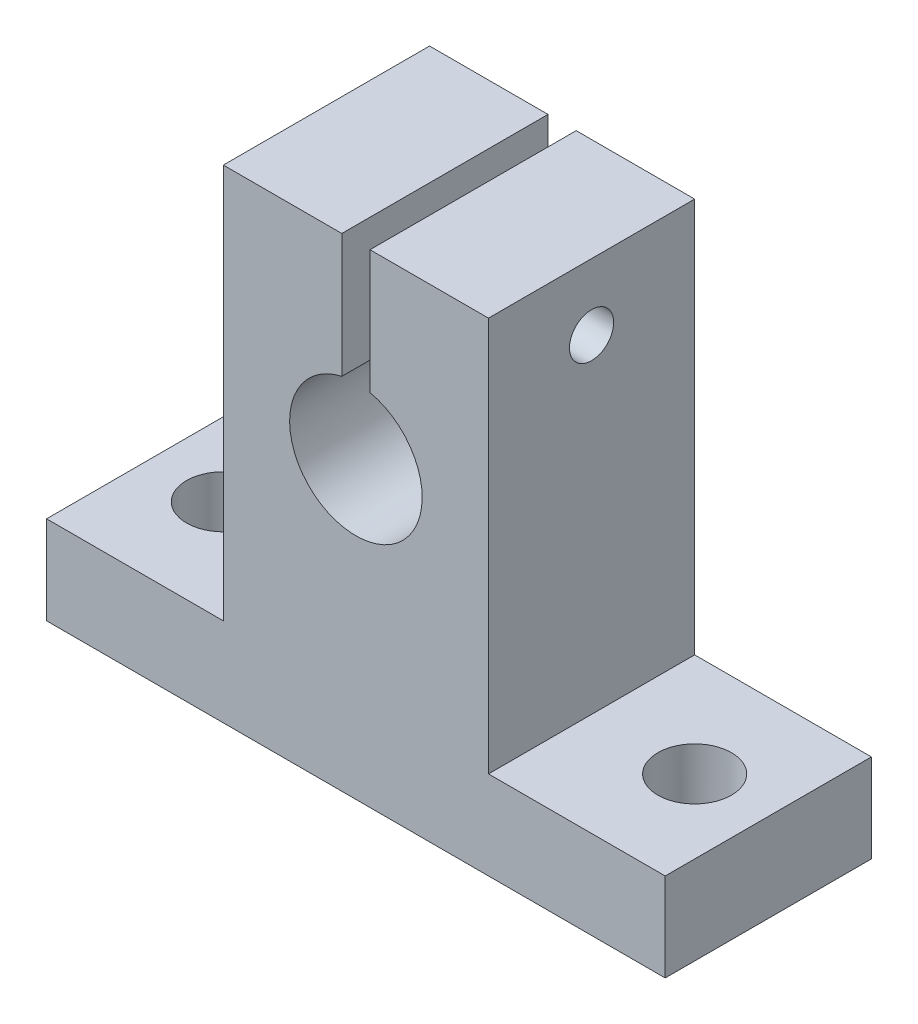
ISO-10303-21;
HEADER;
FILE_DESCRIPTION(('STEP AP214'),'2;1');
FILE_NAME('part.step','',(''),(''),'','','');
FILE_SCHEMA(('AUTOMOTIVE_DESIGN { 1 0 10303 214 1 1 1 1 }'));
ENDSEC;
DATA;
#1=APPLICATION_CONTEXT('core data for automotive mechanical design processes');
#2=APPLICATION_PROTOCOL_DEFINITION('international standard','automotive_design',2000,#1);
#3=PRODUCT_CONTEXT('',#1,'mechanical');
#4=PRODUCT('Part','Part','',(#3));
#5=PRODUCT_RELATED_PRODUCT_CATEGORY('part','',(#4));
#6=PRODUCT_DEFINITION_FORMATION('','',#4);
#7=PRODUCT_DEFINITION_CONTEXT('part definition',#1,'design');
#8=PRODUCT_DEFINITION('design','',#6,#7);
#9=PRODUCT_DEFINITION_SHAPE('','',#8);
#10=(LENGTH_UNIT() NAMED_UNIT(*) SI_UNIT(.MILLI.,.METRE.));
#11=(NAMED_UNIT(*) PLANE_ANGLE_UNIT() SI_UNIT($,.RADIAN.));
#12=(NAMED_UNIT(*) SI_UNIT($,.STERADIAN.) SOLID_ANGLE_UNIT());
#13=UNCERTAINTY_MEASURE_WITH_UNIT(LENGTH_MEASURE(1.E-05),#10,'distance_accuracy_value','');
#14=(GEOMETRIC_REPRESENTATION_CONTEXT(3) GLOBAL_UNCERTAINTY_ASSIGNED_CONTEXT((#13)) GLOBAL_UNIT_ASSIGNED_CONTEXT((#10,
#11,#12)) REPRESENTATION_CONTEXT('',''));
#15=CARTESIAN_POINT('',(0.,0.,0.));
#16=DIRECTION('',(0.,0.,1.));
#17=DIRECTION('',(1.,0.,0.));
#18=AXIS2_PLACEMENT_3D('',#15,#16,#17);
#19=CARTESIAN_POINT('',(21.,3.,14.));
#20=DIRECTION('',(-1.,0.,0.));
#21=DIRECTION('',(0.,0.,1.));
#22=AXIS2_PLACEMENT_3D('',#19,#20,#21);
#23=PLANE('',#22);
#24=DIRECTION('',(0.,1.,0.));
#25=VECTOR('',#24,1.);
#26=CARTESIAN_POINT('',(21.,3.,0.));
#27=LINE('',#26,#25);
#28=CARTESIAN_POINT('',(21.,-3.,0.));
#29=VERTEX_POINT('',#28);
#30=CARTESIAN_POINT('',(21.,3.,0.));
#31=VERTEX_POINT('',#30);
#32=EDGE_CURVE('E154',#29,#31,#27,.T.);
#33=ORIENTED_EDGE('',*,*,#32,.T.);
#34=DIRECTION('',(0.,0.,-1.));
#35=VECTOR('',#34,1.);
#36=CARTESIAN_POINT('',(21.,3.,14.));
#37=LINE('',#36,#35);
#38=CARTESIAN_POINT('',(21.,3.,14.));
#39=VERTEX_POINT('',#38);
#40=EDGE_CURVE('E11',#39,#31,#37,.T.);
#41=ORIENTED_EDGE('',*,*,#40,.F.);
#42=DIRECTION('',(0.,1.,0.));
#43=VECTOR('',#42,1.);
#44=CARTESIAN_POINT('',(21.,3.,14.));
#45=LINE('',#44,#43);
#46=CARTESIAN_POINT('',(21.,-3.,14.));
#47=VERTEX_POINT('',#46);
#48=EDGE_CURVE('E177',#47,#39,#45,.T.);
#49=ORIENTED_EDGE('',*,*,#48,.F.);
#50=DIRECTION('',(0.,0.,-1.));
#51=VECTOR('',#50,1.);
#52=CARTESIAN_POINT('',(21.,-3.,14.));
#53=LINE('',#52,#51);
#54=EDGE_CURVE('E150',#47,#29,#53,.T.);
#55=ORIENTED_EDGE('',*,*,#54,.T.);
#56=EDGE_LOOP('',(#33,#41,#49,#55));
#57=FACE_BOUND('',#56,.T.);
#58=ADVANCED_FACE('F34',(#57),#23,.F.);
#59=CARTESIAN_POINT('',(9.,3.,14.));
#60=DIRECTION('',(0.,-1.,0.));
#61=DIRECTION('',(1.,0.,0.));
#62=AXIS2_PLACEMENT_3D('',#59,#60,#61);
#63=PLANE('',#62);
#64=CARTESIAN_POINT('',(16.,3.,7.));
#65=DIRECTION('',(0.,1.,0.));
#66=DIRECTION('',(1.,0.,0.));
#67=AXIS2_PLACEMENT_3D('',#64,#65,#66);
#68=CIRCLE('',#67,2.5);
#69=CARTESIAN_POINT('',(18.5,3.,7.));
#70=VERTEX_POINT('',#69);
#71=EDGE_CURVE('E303',#70,#70,#68,.T.);
#72=ORIENTED_EDGE('',*,*,#71,.F.);
#73=EDGE_LOOP('',(#72));
#74=FACE_BOUND('',#73,.T.);
#75=DIRECTION('',(-1.,0.,0.));
#76=VECTOR('',#75,1.);
#77=CARTESIAN_POINT('',(9.,3.,0.));
#78=LINE('',#77,#76);
#79=CARTESIAN_POINT('',(9.,3.,0.));
#80=VERTEX_POINT('',#79);
#81=EDGE_CURVE('E157',#31,#80,#78,.T.);
#82=ORIENTED_EDGE('',*,*,#81,.T.);
#83=DIRECTION('',(0.,0.,-1.));
#84=VECTOR('',#83,1.);
#85=CARTESIAN_POINT('',(9.,3.,14.));
#86=LINE('',#85,#84);
#87=CARTESIAN_POINT('',(9.,3.,14.));
#88=VERTEX_POINT('',#87);
#89=EDGE_CURVE('E42',#88,#80,#86,.T.);
#90=ORIENTED_EDGE('',*,*,#89,.F.);
#91=DIRECTION('',(-1.,0.,0.));
#92=VECTOR('',#91,1.);
#93=CARTESIAN_POINT('',(9.,3.,14.));
#94=LINE('',#93,#92);
#95=EDGE_CURVE('E105',#39,#88,#94,.T.);
#96=ORIENTED_EDGE('',*,*,#95,.F.);
#97=ORIENTED_EDGE('',*,*,#40,.T.);
#98=EDGE_LOOP('',(#82,#90,#96,#97));
#99=FACE_BOUND('',#98,.T.);
#100=ADVANCED_FACE('F260',(#74,#99),#63,.F.);
#101=CARTESIAN_POINT('',(9.,29.8,14.));
#102=DIRECTION('',(-1.,0.,0.));
#103=DIRECTION('',(0.,-1.,0.));
#104=AXIS2_PLACEMENT_3D('',#101,#102,#103);
#105=PLANE('',#104);
#106=CARTESIAN_POINT('',(9.,25.3,7.));
#107=DIRECTION('',(-1.,0.,0.));
#108=DIRECTION('',(0.,-1.,0.));
#109=AXIS2_PLACEMENT_3D('',#106,#107,#108);
#110=CIRCLE('',#109,1.5);
#111=CARTESIAN_POINT('',(9.,23.8,7.));
#112=VERTEX_POINT('',#111);
#113=EDGE_CURVE('E306',#112,#112,#110,.T.);
#114=ORIENTED_EDGE('',*,*,#113,.T.);
#115=EDGE_LOOP('',(#114));
#116=FACE_BOUND('',#115,.T.);
#117=DIRECTION('',(0.,1.,0.));
#118=VECTOR('',#117,1.);
#119=CARTESIAN_POINT('',(9.,29.8,0.));
#120=LINE('',#119,#118);
#121=CARTESIAN_POINT('',(9.,29.8,0.));
#122=VERTEX_POINT('',#121);
#123=EDGE_CURVE('E160',#80,#122,#120,.T.);
#124=ORIENTED_EDGE('',*,*,#123,.T.);
#125=DIRECTION('',(0.,0.,-1.));
#126=VECTOR('',#125,1.);
#127=CARTESIAN_POINT('',(9.,29.8,14.));
#128=LINE('',#127,#126);
#129=CARTESIAN_POINT('',(9.,29.8,14.));
#130=VERTEX_POINT('',#129);
#131=EDGE_CURVE('E196',#130,#122,#128,.T.);
#132=ORIENTED_EDGE('',*,*,#131,.F.);
#133=DIRECTION('',(0.,1.,0.));
#134=VECTOR('',#133,1.);
#135=CARTESIAN_POINT('',(9.,29.8,14.));
#136=LINE('',#135,#134);
#137=EDGE_CURVE('E204',#88,#130,#136,.T.);
#138=ORIENTED_EDGE('',*,*,#137,.F.);
#139=ORIENTED_EDGE('',*,*,#89,.T.);
#140=EDGE_LOOP('',(#124,#132,#138,#139));
#141=FACE_BOUND('',#140,.T.);
#142=ADVANCED_FACE('F202',(#116,#141),#105,.F.);
#143=CARTESIAN_POINT('',(0.956301859519476,29.8,14.));
#144=DIRECTION('',(0.,-1.,0.));
#145=DIRECTION('',(0.,0.,-1.));
#146=AXIS2_PLACEMENT_3D('',#143,#144,#145);
#147=PLANE('',#146);
#148=DIRECTION('',(-1.,0.,0.));
#149=VECTOR('',#148,1.);
#150=CARTESIAN_POINT('',(0.956301859519476,29.8,0.));
#151=LINE('',#150,#149);
#152=CARTESIAN_POINT('',(0.956301859519476,29.8,0.));
#153=VERTEX_POINT('',#152);
#154=EDGE_CURVE('E162',#122,#153,#151,.T.);
#155=ORIENTED_EDGE('',*,*,#154,.T.);
#156=DIRECTION('',(0.,0.,-1.));
#157=VECTOR('',#156,1.);
#158=CARTESIAN_POINT('',(0.956301859519476,29.8,14.));
#159=LINE('',#158,#157);
#160=CARTESIAN_POINT('',(0.956301859519476,29.8,14.));
#161=VERTEX_POINT('',#160);
#162=EDGE_CURVE('E193',#161,#153,#159,.T.);
#163=ORIENTED_EDGE('',*,*,#162,.F.);
#164=DIRECTION('',(-1.,0.,0.));
#165=VECTOR('',#164,1.);
#166=CARTESIAN_POINT('',(0.956301859519476,29.8,14.));
#167=LINE('',#166,#165);
#168=EDGE_CURVE('E222',#130,#161,#167,.T.);
#169=ORIENTED_EDGE('',*,*,#168,.F.);
#170=ORIENTED_EDGE('',*,*,#131,.T.);
#171=EDGE_LOOP('',(#155,#163,#169,#170));
#172=FACE_BOUND('',#171,.T.);
#173=ADVANCED_FACE('F213',(#172),#147,.F.);
#174=CARTESIAN_POINT('',(0.956301859519476,29.8,14.));
#175=DIRECTION('',(1.,0.,0.));
#176=DIRECTION('',(0.,1.,0.));
#177=AXIS2_PLACEMENT_3D('',#174,#175,#176);
#178=PLANE('',#177);
#179=CARTESIAN_POINT('',(0.956301859519476,25.3,7.));
#180=DIRECTION('',(1.,0.,0.));
#181=DIRECTION('',(0.,1.,0.));
#182=AXIS2_PLACEMENT_3D('',#179,#180,#181);
#183=CIRCLE('',#182,1.5);
#184=CARTESIAN_POINT('',(0.956301859519477,26.8,7.));
#185=VERTEX_POINT('',#184);
#186=EDGE_CURVE('E314',#185,#185,#183,.T.);
#187=ORIENTED_EDGE('',*,*,#186,.T.);
#188=EDGE_LOOP('',(#187));
#189=FACE_BOUND('',#188,.T.);
#190=DIRECTION('',(0.,-1.,0.));
#191=VECTOR('',#190,1.);
#192=CARTESIAN_POINT('',(0.956301859519476,29.8,0.));
#193=LINE('',#192,#191);
#194=CARTESIAN_POINT('',(0.956301859519474,21.3972135214792,0.));
#195=VERTEX_POINT('',#194);
#196=EDGE_CURVE('E164',#153,#195,#193,.T.);
#197=ORIENTED_EDGE('',*,*,#196,.T.);
#198=DIRECTION('',(0.,0.,-1.));
#199=VECTOR('',#198,1.);
#200=CARTESIAN_POINT('',(0.956301859519474,21.3972135214792,14.));
#201=LINE('',#200,#199);
#202=CARTESIAN_POINT('',(0.956301859519474,21.3972135214792,14.));
#203=VERTEX_POINT('',#202);
#204=EDGE_CURVE('E190',#203,#195,#201,.T.);
#205=ORIENTED_EDGE('',*,*,#204,.F.);
#206=DIRECTION('',(0.,-1.,0.));
#207=VECTOR('',#206,1.);
#208=CARTESIAN_POINT('',(0.956301859519476,29.8,14.));
#209=LINE('',#208,#207);
#210=EDGE_CURVE('E219',#161,#203,#209,.T.);
#211=ORIENTED_EDGE('',*,*,#210,.F.);
#212=ORIENTED_EDGE('',*,*,#162,.T.);
#213=EDGE_LOOP('',(#197,#205,#211,#212));
#214=FACE_BOUND('',#213,.T.);
#215=ADVANCED_FACE('F217',(#189,#214),#178,.F.);
#216=CARTESIAN_POINT('',(0.,17.,14.));
#217=DIRECTION('',(0.,0.,-1.));
#218=DIRECTION('',(-1.,0.,0.));
#219=AXIS2_PLACEMENT_3D('',#216,#217,#218);
#220=CYLINDRICAL_SURFACE('',#219,4.5);
#221=CARTESIAN_POINT('',(0.,17.,0.));
#222=DIRECTION('',(0.,0.,-1.));
#223=DIRECTION('',(1.,0.,0.));
#224=AXIS2_PLACEMENT_3D('',#221,#222,#223);
#225=CIRCLE('',#224,4.5);
#226=CARTESIAN_POINT('',(-0.956301859519469,21.3972135214792,0.));
#227=VERTEX_POINT('',#226);
#228=EDGE_CURVE('E166',#195,#227,#225,.T.);
#229=ORIENTED_EDGE('',*,*,#228,.T.);
#230=DIRECTION('',(0.,0.,-1.));
#231=VECTOR('',#230,1.);
#232=CARTESIAN_POINT('',(-0.956301859519469,21.3972135214792,14.));
#233=LINE('',#232,#231);
#234=CARTESIAN_POINT('',(-0.956301859519469,21.3972135214792,14.));
#235=VERTEX_POINT('',#234);
#236=EDGE_CURVE('E187',#235,#227,#233,.T.);
#237=ORIENTED_EDGE('',*,*,#236,.F.);
#238=CARTESIAN_POINT('',(0.,17.,14.));
#239=DIRECTION('',(0.,0.,-1.));
#240=DIRECTION('',(1.,0.,0.));
#241=AXIS2_PLACEMENT_3D('',#238,#239,#240);
#242=CIRCLE('',#241,4.5);
#243=EDGE_CURVE('E221',#203,#235,#242,.T.);
#244=ORIENTED_EDGE('',*,*,#243,.F.);
#245=ORIENTED_EDGE('',*,*,#204,.T.);
#246=EDGE_LOOP('',(#229,#237,#244,#245));
#247=FACE_BOUND('',#246,.T.);
#248=ADVANCED_FACE('F277',(#247),#220,.F.);
#249=CARTESIAN_POINT('',(-0.956301859519469,29.8,14.));
#250=DIRECTION('',(-1.,0.,0.));
#251=DIRECTION('',(0.,0.,1.));
#252=AXIS2_PLACEMENT_3D('',#249,#250,#251);
#253=PLANE('',#252);
#254=CARTESIAN_POINT('',(-0.956301859519469,25.3,7.));
#255=DIRECTION('',(-1.,0.,0.));
#256=DIRECTION('',(0.,0.,1.));
#257=AXIS2_PLACEMENT_3D('',#254,#255,#256);
#258=CIRCLE('',#257,1.5);
#259=CARTESIAN_POINT('',(-0.956301859519469,25.3,8.5));
#260=VERTEX_POINT('',#259);
#261=EDGE_CURVE('E317',#260,#260,#258,.T.);
#262=ORIENTED_EDGE('',*,*,#261,.T.);
#263=EDGE_LOOP('',(#262));
#264=FACE_BOUND('',#263,.T.);
#265=DIRECTION('',(0.,1.,0.));
#266=VECTOR('',#265,1.);
#267=CARTESIAN_POINT('',(-0.956301859519469,29.8,0.));
#268=LINE('',#267,#266);
#269=CARTESIAN_POINT('',(-0.956301859519469,29.8,0.));
#270=VERTEX_POINT('',#269);
#271=EDGE_CURVE('E168',#227,#270,#268,.T.);
#272=ORIENTED_EDGE('',*,*,#271,.T.);
#273=DIRECTION('',(0.,0.,-1.));
#274=VECTOR('',#273,1.);
#275=CARTESIAN_POINT('',(-0.956301859519469,29.8,14.));
#276=LINE('',#275,#274);
#277=CARTESIAN_POINT('',(-0.956301859519469,29.8,14.));
#278=VERTEX_POINT('',#277);
#279=EDGE_CURVE('E184',#278,#270,#276,.T.);
#280=ORIENTED_EDGE('',*,*,#279,.F.);
#281=DIRECTION('',(0.,1.,0.));
#282=VECTOR('',#281,1.);
#283=CARTESIAN_POINT('',(-0.956301859519469,29.8,14.));
#284=LINE('',#283,#282);
#285=EDGE_CURVE('E224',#235,#278,#284,.T.);
#286=ORIENTED_EDGE('',*,*,#285,.F.);
#287=ORIENTED_EDGE('',*,*,#236,.T.);
#288=EDGE_LOOP('',(#272,#280,#286,#287));
#289=FACE_BOUND('',#288,.T.);
#290=ADVANCED_FACE('F281',(#264,#289),#253,.F.);
#291=CARTESIAN_POINT('',(-9.,29.8,14.));
#292=DIRECTION('',(0.,-1.,0.));
#293=DIRECTION('',(0.,0.,-1.));
#294=AXIS2_PLACEMENT_3D('',#291,#292,#293);
#295=PLANE('',#294);
#296=DIRECTION('',(-1.,0.,0.));
#297=VECTOR('',#296,1.);
#298=CARTESIAN_POINT('',(-9.,29.8,0.));
#299=LINE('',#298,#297);
#300=CARTESIAN_POINT('',(-9.,29.8,0.));
#301=VERTEX_POINT('',#300);
#302=EDGE_CURVE('E170',#270,#301,#299,.T.);
#303=ORIENTED_EDGE('',*,*,#302,.T.);
#304=DIRECTION('',(0.,0.,-1.));
#305=VECTOR('',#304,1.);
#306=CARTESIAN_POINT('',(-9.,29.8,14.));
#307=LINE('',#306,#305);
#308=CARTESIAN_POINT('',(-9.,29.8,14.));
#309=VERTEX_POINT('',#308);
#310=EDGE_CURVE('E181',#309,#301,#307,.T.);
#311=ORIENTED_EDGE('',*,*,#310,.F.);
#312=DIRECTION('',(-1.,0.,0.));
#313=VECTOR('',#312,1.);
#314=CARTESIAN_POINT('',(-9.,29.8,14.));
#315=LINE('',#314,#313);
#316=EDGE_CURVE('E230',#278,#309,#315,.T.);
#317=ORIENTED_EDGE('',*,*,#316,.F.);
#318=ORIENTED_EDGE('',*,*,#279,.T.);
#319=EDGE_LOOP('',(#303,#311,#317,#318));
#320=FACE_BOUND('',#319,.T.);
#321=ADVANCED_FACE('F236',(#320),#295,.F.);
#322=CARTESIAN_POINT('',(-9.,29.8,14.));
#323=DIRECTION('',(1.,0.,0.));
#324=DIRECTION('',(0.,1.,0.));
#325=AXIS2_PLACEMENT_3D('',#322,#323,#324);
#326=PLANE('',#325);
#327=CARTESIAN_POINT('',(-9.,25.3,7.));
#328=DIRECTION('',(-1.,0.,0.));
#329=DIRECTION('',(0.,-1.,0.));
#330=AXIS2_PLACEMENT_3D('',#327,#328,#329);
#331=CIRCLE('',#330,1.5);
#332=CARTESIAN_POINT('',(-9.,23.8,7.));
#333=VERTEX_POINT('',#332);
#334=EDGE_CURVE('E320',#333,#333,#331,.T.);
#335=ORIENTED_EDGE('',*,*,#334,.F.);
#336=EDGE_LOOP('',(#335));
#337=FACE_BOUND('',#336,.T.);
#338=DIRECTION('',(0.,-1.,0.));
#339=VECTOR('',#338,1.);
#340=CARTESIAN_POINT('',(-9.,29.8,0.));
#341=LINE('',#340,#339);
#342=CARTESIAN_POINT('',(-9.,3.,0.));
#343=VERTEX_POINT('',#342);
#344=EDGE_CURVE('E172',#301,#343,#341,.T.);
#345=ORIENTED_EDGE('',*,*,#344,.T.);
#346=DIRECTION('',(0.,0.,-1.));
#347=VECTOR('',#346,1.);
#348=CARTESIAN_POINT('',(-9.,3.,14.));
#349=LINE('',#348,#347);
#350=CARTESIAN_POINT('',(-9.,3.,14.));
#351=VERTEX_POINT('',#350);
#352=EDGE_CURVE('E145',#351,#343,#349,.T.);
#353=ORIENTED_EDGE('',*,*,#352,.F.);
#354=DIRECTION('',(0.,-1.,0.));
#355=VECTOR('',#354,1.);
#356=CARTESIAN_POINT('',(-9.,29.8,14.));
#357=LINE('',#356,#355);
#358=EDGE_CURVE('E136',#309,#351,#357,.T.);
#359=ORIENTED_EDGE('',*,*,#358,.F.);
#360=ORIENTED_EDGE('',*,*,#310,.T.);
#361=EDGE_LOOP('',(#345,#353,#359,#360));
#362=FACE_BOUND('',#361,.T.);
#363=ADVANCED_FACE('F240',(#337,#362),#326,.F.);
#364=CARTESIAN_POINT('',(-21.,3.,14.));
#365=DIRECTION('',(0.,-1.,0.));
#366=DIRECTION('',(1.,0.,0.));
#367=AXIS2_PLACEMENT_3D('',#364,#365,#366);
#368=PLANE('',#367);
#369=CARTESIAN_POINT('',(-16.,3.,7.));
#370=DIRECTION('',(0.,1.,0.));
#371=DIRECTION('',(-1.,0.,0.));
#372=AXIS2_PLACEMENT_3D('',#369,#370,#371);
#373=CIRCLE('',#372,2.5);
#374=CARTESIAN_POINT('',(-18.5,3.,7.));
#375=VERTEX_POINT('',#374);
#376=EDGE_CURVE('E296',#375,#375,#373,.T.);
#377=ORIENTED_EDGE('',*,*,#376,.F.);
#378=EDGE_LOOP('',(#377));
#379=FACE_BOUND('',#378,.T.);
#380=DIRECTION('',(-1.,0.,0.));
#381=VECTOR('',#380,1.);
#382=CARTESIAN_POINT('',(-21.,3.,0.));
#383=LINE('',#382,#381);
#384=CARTESIAN_POINT('',(-21.,3.,0.));
#385=VERTEX_POINT('',#384);
#386=EDGE_CURVE('E144',#343,#385,#383,.T.);
#387=ORIENTED_EDGE('',*,*,#386,.T.);
#388=DIRECTION('',(0.,0.,-1.));
#389=VECTOR('',#388,1.);
#390=CARTESIAN_POINT('',(-21.,3.,14.));
#391=LINE('',#390,#389);
#392=CARTESIAN_POINT('',(-21.,3.,14.));
#393=VERTEX_POINT('',#392);
#394=EDGE_CURVE('E141',#393,#385,#391,.T.);
#395=ORIENTED_EDGE('',*,*,#394,.F.);
#396=DIRECTION('',(-1.,0.,0.));
#397=VECTOR('',#396,1.);
#398=CARTESIAN_POINT('',(-21.,3.,14.));
#399=LINE('',#398,#397);
#400=EDGE_CURVE('E130',#351,#393,#399,.T.);
#401=ORIENTED_EDGE('',*,*,#400,.F.);
#402=ORIENTED_EDGE('',*,*,#352,.T.);
#403=EDGE_LOOP('',(#387,#395,#401,#402));
#404=FACE_BOUND('',#403,.T.);
#405=ADVANCED_FACE('F142',(#379,#404),#368,.F.);
#406=CARTESIAN_POINT('',(-21.,3.,14.));
#407=DIRECTION('',(1.,0.,0.));
#408=DIRECTION('',(0.,0.,-1.));
#409=AXIS2_PLACEMENT_3D('',#406,#407,#408);
#410=PLANE('',#409);
#411=DIRECTION('',(0.,-1.,0.));
#412=VECTOR('',#411,1.);
#413=CARTESIAN_POINT('',(-21.,3.,0.));
#414=LINE('',#413,#412);
#415=CARTESIAN_POINT('',(-21.,-3.,0.));
#416=VERTEX_POINT('',#415);
#417=EDGE_CURVE('E91',#385,#416,#414,.T.);
#418=ORIENTED_EDGE('',*,*,#417,.T.);
#419=DIRECTION('',(0.,0.,-1.));
#420=VECTOR('',#419,1.);
#421=CARTESIAN_POINT('',(-21.,-3.,14.));
#422=LINE('',#421,#420);
#423=CARTESIAN_POINT('',(-21.,-3.,14.));
#424=VERTEX_POINT('',#423);
#425=EDGE_CURVE('E146',#424,#416,#422,.T.);
#426=ORIENTED_EDGE('',*,*,#425,.F.);
#427=DIRECTION('',(0.,-1.,0.));
#428=VECTOR('',#427,1.);
#429=CARTESIAN_POINT('',(-21.,3.,14.));
#430=LINE('',#429,#428);
#431=EDGE_CURVE('E134',#393,#424,#430,.T.);
#432=ORIENTED_EDGE('',*,*,#431,.F.);
#433=ORIENTED_EDGE('',*,*,#394,.T.);
#434=EDGE_LOOP('',(#418,#426,#432,#433));
#435=FACE_BOUND('',#434,.T.);
#436=ADVANCED_FACE('F148',(#435),#410,.F.);
#437=CARTESIAN_POINT('',(-21.,-3.,14.));
#438=DIRECTION('',(0.,1.,0.));
#439=DIRECTION('',(0.,0.,1.));
#440=AXIS2_PLACEMENT_3D('',#437,#438,#439);
#441=PLANE('',#440);
#442=CARTESIAN_POINT('',(-16.,-3.,7.));
#443=DIRECTION('',(0.,1.,0.));
#444=DIRECTION('',(0.,0.,1.));
#445=AXIS2_PLACEMENT_3D('',#442,#443,#444);
#446=CIRCLE('',#445,2.5);
#447=CARTESIAN_POINT('',(-16.,-3.,9.5));
#448=VERTEX_POINT('',#447);
#449=EDGE_CURVE('E158',#448,#448,#446,.F.);
#450=ORIENTED_EDGE('',*,*,#449,.F.);
#451=EDGE_LOOP('',(#450));
#452=FACE_BOUND('',#451,.T.);
#453=CARTESIAN_POINT('',(16.,-3.,7.));
#454=DIRECTION('',(0.,1.,0.));
#455=DIRECTION('',(0.,0.,1.));
#456=AXIS2_PLACEMENT_3D('',#453,#454,#455);
#457=CIRCLE('',#456,2.5);
#458=CARTESIAN_POINT('',(16.,-3.,9.49999999999999));
#459=VERTEX_POINT('',#458);
#460=EDGE_CURVE('E298',#459,#459,#457,.F.);
#461=ORIENTED_EDGE('',*,*,#460,.F.);
#462=EDGE_LOOP('',(#461));
#463=FACE_BOUND('',#462,.T.);
#464=DIRECTION('',(1.,0.,0.));
#465=VECTOR('',#464,1.);
#466=CARTESIAN_POINT('',(-21.,-3.,0.));
#467=LINE('',#466,#465);
#468=EDGE_CURVE('E97',#416,#29,#467,.T.);
#469=ORIENTED_EDGE('',*,*,#468,.T.);
#470=ORIENTED_EDGE('',*,*,#54,.F.);
#471=DIRECTION('',(1.,0.,0.));
#472=VECTOR('',#471,1.);
#473=CARTESIAN_POINT('',(-21.,-3.,14.));
#474=LINE('',#473,#472);
#475=EDGE_CURVE('E50',#424,#47,#474,.T.);
#476=ORIENTED_EDGE('',*,*,#475,.F.);
#477=ORIENTED_EDGE('',*,*,#425,.T.);
#478=EDGE_LOOP('',(#469,#470,#476,#477));
#479=FACE_BOUND('',#478,.T.);
#480=ADVANCED_FACE('F244',(#452,#463,#479),#441,.F.);
#481=CARTESIAN_POINT('',(0.,17.,14.));
#482=DIRECTION('',(0.,0.,1.));
#483=DIRECTION('',(1.,0.,0.));
#484=AXIS2_PLACEMENT_3D('',#481,#482,#483);
#485=PLANE('',#484);
#486=ORIENTED_EDGE('',*,*,#48,.T.);
#487=ORIENTED_EDGE('',*,*,#95,.T.);
#488=ORIENTED_EDGE('',*,*,#137,.T.);
#489=ORIENTED_EDGE('',*,*,#168,.T.);
#490=ORIENTED_EDGE('',*,*,#210,.T.);
#491=ORIENTED_EDGE('',*,*,#243,.T.);
#492=ORIENTED_EDGE('',*,*,#285,.T.);
#493=ORIENTED_EDGE('',*,*,#316,.T.);
#494=ORIENTED_EDGE('',*,*,#358,.T.);
#495=ORIENTED_EDGE('',*,*,#400,.T.);
#496=ORIENTED_EDGE('',*,*,#431,.T.);
#497=ORIENTED_EDGE('',*,*,#475,.T.);
#498=EDGE_LOOP('',(#486,#487,#488,#489,#490,#491,#492,#493,#494,#495,#496,#497));
#499=FACE_BOUND('',#498,.T.);
#500=ADVANCED_FACE('F132',(#499),#485,.T.);
#501=CARTESIAN_POINT('',(0.,17.,0.));
#502=DIRECTION('',(0.,0.,1.));
#503=DIRECTION('',(1.,0.,0.));
#504=AXIS2_PLACEMENT_3D('',#501,#502,#503);
#505=PLANE('',#504);
#506=ORIENTED_EDGE('',*,*,#32,.F.);
#507=ORIENTED_EDGE('',*,*,#468,.F.);
#508=ORIENTED_EDGE('',*,*,#417,.F.);
#509=ORIENTED_EDGE('',*,*,#386,.F.);
#510=ORIENTED_EDGE('',*,*,#344,.F.);
#511=ORIENTED_EDGE('',*,*,#302,.F.);
#512=ORIENTED_EDGE('',*,*,#271,.F.);
#513=ORIENTED_EDGE('',*,*,#228,.F.);
#514=ORIENTED_EDGE('',*,*,#196,.F.);
#515=ORIENTED_EDGE('',*,*,#154,.F.);
#516=ORIENTED_EDGE('',*,*,#123,.F.);
#517=ORIENTED_EDGE('',*,*,#81,.F.);
#518=EDGE_LOOP('',(#506,#507,#508,#509,#510,#511,#512,#513,#514,#515,#516,#517));
#519=FACE_BOUND('',#518,.T.);
#520=ADVANCED_FACE('F208',(#519),#505,.F.);
#521=CARTESIAN_POINT('',(16.,-3.001,7.));
#522=DIRECTION('',(0.,1.,0.));
#523=DIRECTION('',(-1.,0.,0.));
#524=AXIS2_PLACEMENT_3D('',#521,#522,#523);
#525=CYLINDRICAL_SURFACE('',#524,2.5);
#526=ORIENTED_EDGE('',*,*,#71,.T.);
#527=EDGE_LOOP('',(#526));
#528=FACE_BOUND('',#527,.T.);
#529=ORIENTED_EDGE('',*,*,#460,.T.);
#530=EDGE_LOOP('',(#529));
#531=FACE_BOUND('',#530,.T.);
#532=ADVANCED_FACE('F341',(#528,#531),#525,.F.);
#533=CARTESIAN_POINT('',(-16.,-3.001,7.));
#534=DIRECTION('',(0.,1.,0.));
#535=DIRECTION('',(-1.,0.,0.));
#536=AXIS2_PLACEMENT_3D('',#533,#534,#535);
#537=CYLINDRICAL_SURFACE('',#536,2.5);
#538=ORIENTED_EDGE('',*,*,#376,.T.);
#539=EDGE_LOOP('',(#538));
#540=FACE_BOUND('',#539,.T.);
#541=ORIENTED_EDGE('',*,*,#449,.T.);
#542=EDGE_LOOP('',(#541));
#543=FACE_BOUND('',#542,.T.);
#544=ADVANCED_FACE('F330',(#540,#543),#537,.F.);
#545=CARTESIAN_POINT('',(21.,25.3,7.));
#546=DIRECTION('',(-1.,0.,0.));
#547=DIRECTION('',(0.,-1.,0.));
#548=AXIS2_PLACEMENT_3D('',#545,#546,#547);
#549=CYLINDRICAL_SURFACE('',#548,1.5);
#550=ORIENTED_EDGE('',*,*,#334,.T.);
#551=EDGE_LOOP('',(#550));
#552=FACE_BOUND('',#551,.T.);
#553=ORIENTED_EDGE('',*,*,#261,.F.);
#554=EDGE_LOOP('',(#553));
#555=FACE_BOUND('',#554,.T.);
#556=ADVANCED_FACE('F326',(#552,#555),#549,.F.);
#557=ORIENTED_EDGE('',*,*,#186,.F.);
#558=EDGE_LOOP('',(#557));
#559=FACE_BOUND('',#558,.T.);
#560=ORIENTED_EDGE('',*,*,#113,.F.);
#561=EDGE_LOOP('',(#560));
#562=FACE_BOUND('',#561,.T.);
#563=ADVANCED_FACE('F329',(#559,#562),#549,.F.);
#564=CLOSED_SHELL('',(#58,#100,#142,#173,#215,#248,#290,#321,#363,#405,#436,#480,#500,#520,#532,
#544,#556,#563));
#565=MANIFOLD_SOLID_BREP('B2',#564);
#566=ADVANCED_BREP_SHAPE_REPRESENTATION('',(#18,#565),#14);
#567=SHAPE_DEFINITION_REPRESENTATION(#9,#566);
ENDSEC;
END-ISO-10303-21;
